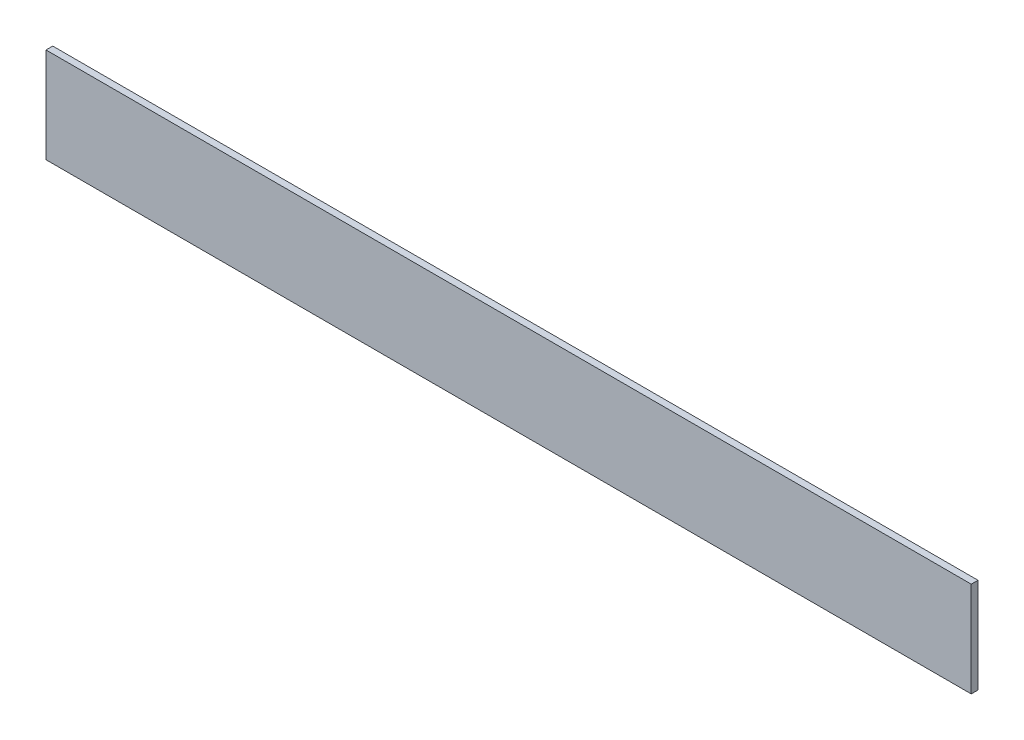
ISO-10303-21;
HEADER;
FILE_DESCRIPTION(('STEP AP214'),'2;1');
FILE_NAME('part.step','',(''),(''),'','','');
FILE_SCHEMA(('AUTOMOTIVE_DESIGN { 1 0 10303 214 1 1 1 1 }'));
ENDSEC;
DATA;
#1=APPLICATION_CONTEXT('core data for automotive mechanical design processes');
#2=APPLICATION_PROTOCOL_DEFINITION('international standard','automotive_design',2000,#1);
#3=PRODUCT_CONTEXT('',#1,'mechanical');
#4=PRODUCT('Part','Part','',(#3));
#5=PRODUCT_RELATED_PRODUCT_CATEGORY('part','',(#4));
#6=PRODUCT_DEFINITION_FORMATION('','',#4);
#7=PRODUCT_DEFINITION_CONTEXT('part definition',#1,'design');
#8=PRODUCT_DEFINITION('design','',#6,#7);
#9=PRODUCT_DEFINITION_SHAPE('','',#8);
#10=(LENGTH_UNIT() NAMED_UNIT(*) SI_UNIT(.MILLI.,.METRE.));
#11=(NAMED_UNIT(*) PLANE_ANGLE_UNIT() SI_UNIT($,.RADIAN.));
#12=(NAMED_UNIT(*) SI_UNIT($,.STERADIAN.) SOLID_ANGLE_UNIT());
#13=UNCERTAINTY_MEASURE_WITH_UNIT(LENGTH_MEASURE(1.E-05),#10,'distance_accuracy_value','');
#14=(GEOMETRIC_REPRESENTATION_CONTEXT(3) GLOBAL_UNCERTAINTY_ASSIGNED_CONTEXT((#13)) GLOBAL_UNIT_ASSIGNED_CONTEXT((#10,
#11,#12)) REPRESENTATION_CONTEXT('',''));
#15=CARTESIAN_POINT('',(0.,0.,0.));
#16=DIRECTION('',(0.,0.,1.));
#17=DIRECTION('',(1.,0.,0.));
#18=AXIS2_PLACEMENT_3D('',#15,#16,#17);
#19=CARTESIAN_POINT('',(217.4875,-22.352,3.175));
#20=DIRECTION('',(-1.,0.,0.));
#21=DIRECTION('',(0.,0.,1.));
#22=AXIS2_PLACEMENT_3D('',#19,#20,#21);
#23=PLANE('',#22);
#24=DIRECTION('',(0.,1.,0.));
#25=VECTOR('',#24,1.);
#26=CARTESIAN_POINT('',(217.4875,-22.352,0.));
#27=LINE('',#26,#25);
#28=CARTESIAN_POINT('',(217.4875,-22.352,0.));
#29=VERTEX_POINT('',#28);
#30=CARTESIAN_POINT('',(217.4875,22.352,0.));
#31=VERTEX_POINT('',#30);
#32=EDGE_CURVE('E98',#29,#31,#27,.T.);
#33=ORIENTED_EDGE('',*,*,#32,.T.);
#34=DIRECTION('',(0.,0.,-1.));
#35=VECTOR('',#34,1.);
#36=CARTESIAN_POINT('',(217.4875,22.352,3.175));
#37=LINE('',#36,#35);
#38=CARTESIAN_POINT('',(217.4875,22.352,3.175));
#39=VERTEX_POINT('',#38);
#40=EDGE_CURVE('E11',#39,#31,#37,.T.);
#41=ORIENTED_EDGE('',*,*,#40,.F.);
#42=DIRECTION('',(0.,1.,0.));
#43=VECTOR('',#42,1.);
#44=CARTESIAN_POINT('',(217.4875,-22.352,3.175));
#45=LINE('',#44,#43);
#46=CARTESIAN_POINT('',(217.4875,-22.352,3.175));
#47=VERTEX_POINT('',#46);
#48=EDGE_CURVE('E86',#47,#39,#45,.T.);
#49=ORIENTED_EDGE('',*,*,#48,.F.);
#50=DIRECTION('',(0.,0.,-1.));
#51=VECTOR('',#50,1.);
#52=CARTESIAN_POINT('',(217.4875,-22.352,3.175));
#53=LINE('',#52,#51);
#54=EDGE_CURVE('E94',#47,#29,#53,.T.);
#55=ORIENTED_EDGE('',*,*,#54,.T.);
#56=EDGE_LOOP('',(#33,#41,#49,#55));
#57=FACE_BOUND('',#56,.T.);
#58=ADVANCED_FACE('F35',(#57),#23,.F.);
#59=CARTESIAN_POINT('',(-217.4875,22.352,3.175));
#60=DIRECTION('',(0.,-1.,0.));
#61=DIRECTION('',(0.,0.,-1.));
#62=AXIS2_PLACEMENT_3D('',#59,#60,#61);
#63=PLANE('',#62);
#64=DIRECTION('',(-1.,0.,0.));
#65=VECTOR('',#64,1.);
#66=CARTESIAN_POINT('',(-217.4875,22.352,0.));
#67=LINE('',#66,#65);
#68=CARTESIAN_POINT('',(-217.4875,22.352,0.));
#69=VERTEX_POINT('',#68);
#70=EDGE_CURVE('E90',#31,#69,#67,.T.);
#71=ORIENTED_EDGE('',*,*,#70,.T.);
#72=DIRECTION('',(0.,0.,-1.));
#73=VECTOR('',#72,1.);
#74=CARTESIAN_POINT('',(-217.4875,22.352,3.175));
#75=LINE('',#74,#73);
#76=CARTESIAN_POINT('',(-217.4875,22.352,3.175));
#77=VERTEX_POINT('',#76);
#78=EDGE_CURVE('E43',#77,#69,#75,.T.);
#79=ORIENTED_EDGE('',*,*,#78,.F.);
#80=DIRECTION('',(-1.,0.,0.));
#81=VECTOR('',#80,1.);
#82=CARTESIAN_POINT('',(-217.4875,22.352,3.175));
#83=LINE('',#82,#81);
#84=EDGE_CURVE('E81',#39,#77,#83,.T.);
#85=ORIENTED_EDGE('',*,*,#84,.F.);
#86=ORIENTED_EDGE('',*,*,#40,.T.);
#87=EDGE_LOOP('',(#71,#79,#85,#86));
#88=FACE_BOUND('',#87,.T.);
#89=ADVANCED_FACE('F89',(#88),#63,.F.);
#90=CARTESIAN_POINT('',(-217.4875,-22.352,3.175));
#91=DIRECTION('',(1.,0.,0.));
#92=DIRECTION('',(0.,0.,-1.));
#93=AXIS2_PLACEMENT_3D('',#90,#91,#92);
#94=PLANE('',#93);
#95=DIRECTION('',(0.,-1.,0.));
#96=VECTOR('',#95,1.);
#97=CARTESIAN_POINT('',(-217.4875,-22.352,0.));
#98=LINE('',#97,#96);
#99=CARTESIAN_POINT('',(-217.4875,-22.352,0.));
#100=VERTEX_POINT('',#99);
#101=EDGE_CURVE('E68',#69,#100,#98,.T.);
#102=ORIENTED_EDGE('',*,*,#101,.T.);
#103=DIRECTION('',(0.,0.,-1.));
#104=VECTOR('',#103,1.);
#105=CARTESIAN_POINT('',(-217.4875,-22.352,3.175));
#106=LINE('',#105,#104);
#107=CARTESIAN_POINT('',(-217.4875,-22.352,3.175));
#108=VERTEX_POINT('',#107);
#109=EDGE_CURVE('E91',#108,#100,#106,.T.);
#110=ORIENTED_EDGE('',*,*,#109,.F.);
#111=DIRECTION('',(0.,-1.,0.));
#112=VECTOR('',#111,1.);
#113=CARTESIAN_POINT('',(-217.4875,-22.352,3.175));
#114=LINE('',#113,#112);
#115=EDGE_CURVE('E84',#77,#108,#114,.T.);
#116=ORIENTED_EDGE('',*,*,#115,.F.);
#117=ORIENTED_EDGE('',*,*,#78,.T.);
#118=EDGE_LOOP('',(#102,#110,#116,#117));
#119=FACE_BOUND('',#118,.T.);
#120=ADVANCED_FACE('F92',(#119),#94,.F.);
#121=CARTESIAN_POINT('',(-217.4875,-22.352,3.175));
#122=DIRECTION('',(0.,1.,0.));
#123=DIRECTION('',(0.,0.,1.));
#124=AXIS2_PLACEMENT_3D('',#121,#122,#123);
#125=PLANE('',#124);
#126=DIRECTION('',(1.,0.,0.));
#127=VECTOR('',#126,1.);
#128=CARTESIAN_POINT('',(-217.4875,-22.352,0.));
#129=LINE('',#128,#127);
#130=EDGE_CURVE('E74',#100,#29,#129,.T.);
#131=ORIENTED_EDGE('',*,*,#130,.T.);
#132=ORIENTED_EDGE('',*,*,#54,.F.);
#133=DIRECTION('',(1.,0.,0.));
#134=VECTOR('',#133,1.);
#135=CARTESIAN_POINT('',(-217.4875,-22.352,3.175));
#136=LINE('',#135,#134);
#137=EDGE_CURVE('E51',#108,#47,#136,.T.);
#138=ORIENTED_EDGE('',*,*,#137,.F.);
#139=ORIENTED_EDGE('',*,*,#109,.T.);
#140=EDGE_LOOP('',(#131,#132,#138,#139));
#141=FACE_BOUND('',#140,.T.);
#142=ADVANCED_FACE('F105',(#141),#125,.F.);
#143=CARTESIAN_POINT('',(0.,0.,3.175));
#144=DIRECTION('',(0.,0.,-1.));
#145=DIRECTION('',(-1.,0.,0.));
#146=AXIS2_PLACEMENT_3D('',#143,#144,#145);
#147=PLANE('',#146);
#148=ORIENTED_EDGE('',*,*,#48,.T.);
#149=ORIENTED_EDGE('',*,*,#84,.T.);
#150=ORIENTED_EDGE('',*,*,#115,.T.);
#151=ORIENTED_EDGE('',*,*,#137,.T.);
#152=EDGE_LOOP('',(#148,#149,#150,#151));
#153=FACE_BOUND('',#152,.T.);
#154=ADVANCED_FACE('F82',(#153),#147,.F.);
#155=CARTESIAN_POINT('',(0.,0.,0.));
#156=DIRECTION('',(0.,0.,-1.));
#157=DIRECTION('',(-1.,0.,0.));
#158=AXIS2_PLACEMENT_3D('',#155,#156,#157);
#159=PLANE('',#158);
#160=ORIENTED_EDGE('',*,*,#32,.F.);
#161=ORIENTED_EDGE('',*,*,#130,.F.);
#162=ORIENTED_EDGE('',*,*,#101,.F.);
#163=ORIENTED_EDGE('',*,*,#70,.F.);
#164=EDGE_LOOP('',(#160,#161,#162,#163));
#165=FACE_BOUND('',#164,.T.);
#166=ADVANCED_FACE('F108',(#165),#159,.T.);
#167=CLOSED_SHELL('',(#58,#89,#120,#142,#154,#166));
#168=MANIFOLD_SOLID_BREP('B2',#167);
#169=ADVANCED_BREP_SHAPE_REPRESENTATION('',(#18,#168),#14);
#170=SHAPE_DEFINITION_REPRESENTATION(#9,#169);
ENDSEC;
END-ISO-10303-21;
